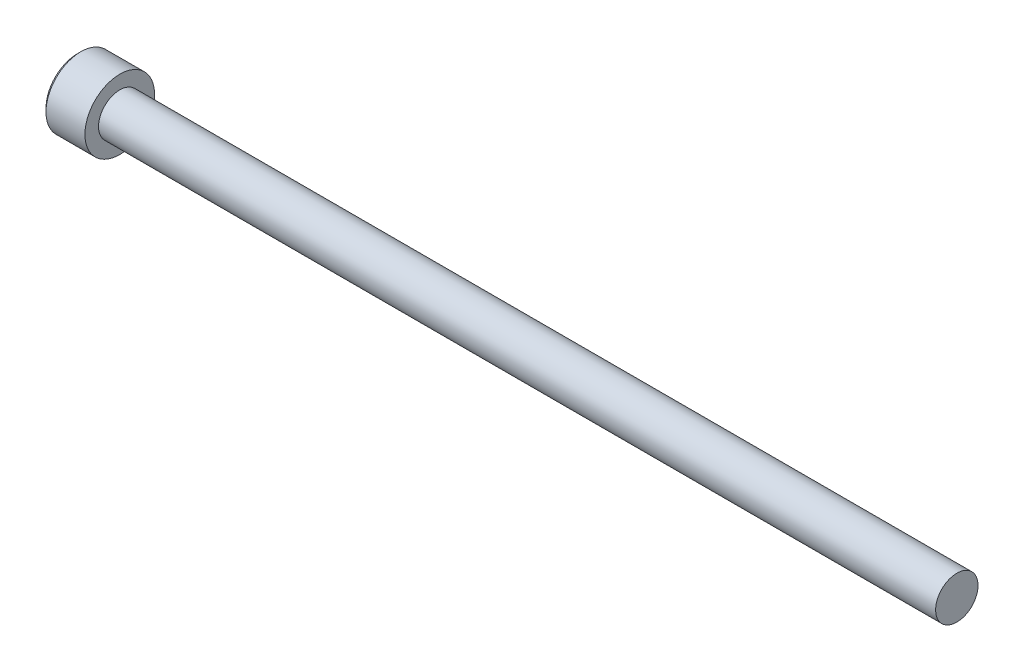
ISO-10303-21;
HEADER;
FILE_DESCRIPTION(('STEP AP214'),'2;1');
FILE_NAME('part.step','',(''),(''),'','','');
FILE_SCHEMA(('AUTOMOTIVE_DESIGN { 1 0 10303 214 1 1 1 1 }'));
ENDSEC;
DATA;
#1=APPLICATION_CONTEXT('core data for automotive mechanical design processes');
#2=APPLICATION_PROTOCOL_DEFINITION('international standard','automotive_design',2000,#1);
#3=PRODUCT_CONTEXT('',#1,'mechanical');
#4=PRODUCT('Part','Part','',(#3));
#5=PRODUCT_RELATED_PRODUCT_CATEGORY('part','',(#4));
#6=PRODUCT_DEFINITION_FORMATION('','',#4);
#7=PRODUCT_DEFINITION_CONTEXT('part definition',#1,'design');
#8=PRODUCT_DEFINITION('design','',#6,#7);
#9=PRODUCT_DEFINITION_SHAPE('','',#8);
#10=(LENGTH_UNIT() NAMED_UNIT(*) SI_UNIT(.MILLI.,.METRE.));
#11=(NAMED_UNIT(*) PLANE_ANGLE_UNIT() SI_UNIT($,.RADIAN.));
#12=(NAMED_UNIT(*) SI_UNIT($,.STERADIAN.) SOLID_ANGLE_UNIT());
#13=UNCERTAINTY_MEASURE_WITH_UNIT(LENGTH_MEASURE(1.E-05),#10,'distance_accuracy_value','');
#14=(GEOMETRIC_REPRESENTATION_CONTEXT(3) GLOBAL_UNCERTAINTY_ASSIGNED_CONTEXT((#13)) GLOBAL_UNIT_ASSIGNED_CONTEXT((#10,
#11,#12)) REPRESENTATION_CONTEXT('',''));
#15=CARTESIAN_POINT('',(0.,0.,0.));
#16=DIRECTION('',(0.,0.,1.));
#17=DIRECTION('',(1.,0.,0.));
#18=AXIS2_PLACEMENT_3D('',#15,#16,#17);
#19=CARTESIAN_POINT('',(-2.28600000000007,-1.14567944042317,1.984375));
#20=DIRECTION('',(0.,0.,1.));
#21=DIRECTION('',(1.,0.,0.));
#22=AXIS2_PLACEMENT_3D('',#19,#20,#21);
#23=PLANE('',#22);
#24=CARTESIAN_POINT('',(-4.82599999995852,1.14567944044653,1.98437499999554));
#25=CARTESIAN_POINT('',(-4.78691618362732,1.06743880343266,1.9843749999984));
#26=CARTESIAN_POINT('',(-4.75011447684892,0.987898318960917,1.98437499999957));
#27=CARTESIAN_POINT('',(-4.68265620500518,0.825677042028778,1.98437500000043));
#28=CARTESIAN_POINT('',(-4.65204056061138,0.742979382529199,1.98437500000012));
#29=CARTESIAN_POINT('',(-4.5991739228306,0.575193959555969,1.98437499999988));
#30=CARTESIAN_POINT('',(-4.57689462080725,0.490115359117279,1.98437499999997));
#31=CARTESIAN_POINT('',(-4.54259467221837,0.318093091130193,1.98437500000003));
#32=CARTESIAN_POINT('',(-4.5305423022885,0.231156054976726,1.984375));
#33=CARTESIAN_POINT('',(-4.52249110263747,0.119918521511051,1.984375));
#34=CARTESIAN_POINT('',(-4.52118947557477,0.0959468443046798,1.984375));
#35=CARTESIAN_POINT('',(-4.51945182629813,0.0479845644411998,1.984375));
#36=CARTESIAN_POINT('',(-4.51901533386223,0.0239939791589393,1.984375));
#37=CARTESIAN_POINT('',(-4.51901809008399,-0.0602201717457363,1.984375));
#38=CARTESIAN_POINT('',(-4.52177452299902,-0.120461721905447,1.984375));
#39=CARTESIAN_POINT('',(-4.5326365512493,-0.240474970989197,1.984375));
#40=CARTESIAN_POINT('',(-4.54074587749718,-0.300246312758427,1.984375));
#41=CARTESIAN_POINT('',(-4.57259622946939,-0.478763752804282,1.984375));
#42=CARTESIAN_POINT('',(-4.60385422611702,-0.596208828937734,1.984375));
#43=CARTESIAN_POINT('',(-4.66780003592237,-0.785921487441256,1.984375));
#44=CARTESIAN_POINT('',(-4.69623457768558,-0.859734609866899,1.984375));
#45=CARTESIAN_POINT('',(-4.75786140400812,-1.00456595519282,1.984375));
#46=CARTESIAN_POINT('',(-4.79100779300359,-1.07560356657101,1.984375));
#47=CARTESIAN_POINT('',(-4.82599999995643,-1.14567944044724,1.984375));
#48=B_SPLINE_CURVE_WITH_KNOTS('',3,(#24,#25,#26,#27,#28,#29,#30,#31,#32,#33,#34,#35,#36,#37,#38,
#39,#40,#41,#42,#43,#44,#45,#46,#47),.UNSPECIFIED.,.F.,.F.,(4,2,2,2,2,2,2,2,2,2,2,4),(0.,
0.262559005207405,0.526801735838036,0.790138824405318,1.05265603861765,1.12466619182083,
1.19663719499031,1.3772702672652,1.55802937209382,1.92104085090328,2.15819130092264,
2.39317265078575),.UNSPECIFIED.);
#49=CARTESIAN_POINT('',(-4.82599999996829,1.14567944041753,1.98437500003084));
#50=VERTEX_POINT('',#49);
#51=CARTESIAN_POINT('',(-4.8259999999622,-1.14567944043207,1.98437500001542));
#52=VERTEX_POINT('',#51);
#53=EDGE_CURVE('E29',#50,#52,#48,.T.);
#54=ORIENTED_EDGE('',*,*,#53,.F.);
#55=DIRECTION('',(1.,0.,0.));
#56=VECTOR('',#55,1.);
#57=CARTESIAN_POINT('',(-2.28600000000007,1.14567944042316,1.984375));
#58=LINE('',#57,#56);
#59=CARTESIAN_POINT('',(-2.28600000000007,1.14567944042316,1.984375));
#60=VERTEX_POINT('',#59);
#61=EDGE_CURVE('E77',#50,#60,#58,.T.);
#62=ORIENTED_EDGE('',*,*,#61,.T.);
#63=DIRECTION('',(0.,1.,0.));
#64=VECTOR('',#63,1.);
#65=CARTESIAN_POINT('',(-2.28600000000007,0.,1.984375));
#66=LINE('',#65,#64);
#67=CARTESIAN_POINT('',(-2.28600000000007,-1.14567944042317,1.984375));
#68=VERTEX_POINT('',#67);
#69=EDGE_CURVE('E83',#68,#60,#66,.T.);
#70=ORIENTED_EDGE('',*,*,#69,.F.);
#71=DIRECTION('',(1.,0.,0.));
#72=VECTOR('',#71,1.);
#73=CARTESIAN_POINT('',(-2.28600000000007,-1.14567944042317,1.984375));
#74=LINE('',#73,#72);
#75=EDGE_CURVE('E80',#68,#52,#74,.F.);
#76=ORIENTED_EDGE('',*,*,#75,.T.);
#77=EDGE_LOOP('',(#54,#62,#70,#76));
#78=FACE_BOUND('',#77,.T.);
#79=ADVANCED_FACE('F25',(#78),#23,.F.);
#80=CARTESIAN_POINT('',(-2.28600000000007,0.,0.));
#81=DIRECTION('',(-1.,0.,0.));
#82=DIRECTION('',(0.,0.,1.));
#83=AXIS2_PLACEMENT_3D('',#80,#81,#82);
#84=PLANE('',#83);
#85=DIRECTION('',(0.,0.5,0.866025403784439));
#86=VECTOR('',#85,1.);
#87=CARTESIAN_POINT('',(-2.28600000000007,2.29135888084633,0.));
#88=LINE('',#87,#86);
#89=CARTESIAN_POINT('',(-2.28600000000007,2.29135888084633,0.));
#90=VERTEX_POINT('',#89);
#91=CARTESIAN_POINT('',(-2.28600000000007,1.14567944042316,-1.984375));
#92=VERTEX_POINT('',#91);
#93=EDGE_CURVE('E91',#90,#92,#88,.F.);
#94=ORIENTED_EDGE('',*,*,#93,.T.);
#95=DIRECTION('',(0.,1.,0.));
#96=VECTOR('',#95,1.);
#97=CARTESIAN_POINT('',(-2.28600000000007,1.14567944042316,-1.984375));
#98=LINE('',#97,#96);
#99=CARTESIAN_POINT('',(-2.28600000000007,-1.14567944042316,-1.984375));
#100=VERTEX_POINT('',#99);
#101=EDGE_CURVE('E251',#92,#100,#98,.F.);
#102=ORIENTED_EDGE('',*,*,#101,.T.);
#103=DIRECTION('',(0.,0.5,-0.866025403784439));
#104=VECTOR('',#103,1.);
#105=CARTESIAN_POINT('',(-2.28600000000007,-1.14567944042316,-1.984375));
#106=LINE('',#105,#104);
#107=CARTESIAN_POINT('',(-2.28600000000007,-2.29135888084633,0.));
#108=VERTEX_POINT('',#107);
#109=EDGE_CURVE('E236',#100,#108,#106,.F.);
#110=ORIENTED_EDGE('',*,*,#109,.T.);
#111=DIRECTION('',(0.,-0.5,-0.866025403784439));
#112=VECTOR('',#111,1.);
#113=CARTESIAN_POINT('',(-2.28600000000007,-2.29135888084633,0.));
#114=LINE('',#113,#112);
#115=EDGE_CURVE('E233',#108,#68,#114,.F.);
#116=ORIENTED_EDGE('',*,*,#115,.T.);
#117=ORIENTED_EDGE('',*,*,#69,.T.);
#118=DIRECTION('',(0.,-0.5,0.866025403784439));
#119=VECTOR('',#118,1.);
#120=CARTESIAN_POINT('',(-2.28600000000007,1.14567944042316,1.984375));
#121=LINE('',#120,#119);
#122=EDGE_CURVE('E90',#60,#90,#121,.F.);
#123=ORIENTED_EDGE('',*,*,#122,.T.);
#124=EDGE_LOOP('',(#94,#102,#110,#116,#117,#123));
#125=FACE_BOUND('',#124,.T.);
#126=ADVANCED_FACE('F169',(#125),#84,.T.);
#127=CARTESIAN_POINT('',(-2.28600000000007,-1.14567944042316,-1.984375));
#128=DIRECTION('',(0.,-0.866025403784439,-0.5));
#129=DIRECTION('',(0.,0.5,-0.866025403784439));
#130=AXIS2_PLACEMENT_3D('',#127,#128,#129);
#131=PLANE('',#130);
#132=CARTESIAN_POINT('',(-4.82599999995871,-1.14567944040756,-1.98437500001887));
#133=CARTESIAN_POINT('',(-4.78666022792997,-1.18505700230148,-1.91617106214563));
#134=CARTESIAN_POINT('',(-4.74963132844072,-1.22509295783734,-1.8468267530301));
#135=CARTESIAN_POINT('',(-4.68183299424977,-1.30673037975396,-1.70542659047317));
#136=CARTESIAN_POINT('',(-4.65110127019237,-1.34833960561553,-1.63335729721673));
#137=CARTESIAN_POINT('',(-4.59845762010516,-1.432242568594,-1.48803310243203));
#138=CARTESIAN_POINT('',(-4.57641341195893,-1.47451494967301,-1.41481519064643));
#139=CARTESIAN_POINT('',(-4.54245011067441,-1.55999007976842,-1.26676792253773));
#140=CARTESIAN_POINT('',(-4.53050567471972,-1.6031902195197,-1.19194308559438));
#141=CARTESIAN_POINT('',(-4.51972842752365,-1.67764765054852,-1.06297903205139));
#142=CARTESIAN_POINT('',(-4.51813352794834,-1.70880881707173,-1.00900630841009));
#143=CARTESIAN_POINT('',(-4.52082392138599,-1.77108016542046,-0.901149169214274));
#144=CARTESIAN_POINT('',(-4.52511127545884,-1.80219032554946,-0.847264791239237));
#145=CARTESIAN_POINT('',(-4.53932219421538,-1.86411684097343,-0.740004920189235));
#146=CARTESIAN_POINT('',(-4.54925206045723,-1.8949328285454,-0.686630064029166));
#147=CARTESIAN_POINT('',(-4.5742029484467,-1.95603190279815,-0.580803363127978));
#148=CARTESIAN_POINT('',(-4.58922357974385,-1.98631503016081,-0.528351447923769));
#149=CARTESIAN_POINT('',(-4.63380478900425,-2.06386502548479,-0.394030915895904));
#150=CARTESIAN_POINT('',(-4.66672213384104,-2.11065153226583,-0.312994309042484));
#151=CARTESIAN_POINT('',(-4.72228952038986,-2.17944749410732,-0.193836207777459));
#152=CARTESIAN_POINT('',(-4.74181309375939,-2.20211890802843,-0.154568166986659));
#153=CARTESIAN_POINT('',(-4.78263970065987,-2.24704195201531,-0.0767591723707469));
#154=CARTESIAN_POINT('',(-4.80394164363173,-2.2692938292399,-0.0382177904539708));
#155=CARTESIAN_POINT('',(-4.82599999995675,-2.29135888085868,2.13931096265935E-11));
#156=B_SPLINE_CURVE_WITH_KNOTS('',3,(#132,#133,#134,#135,#136,#137,#138,#139,#140,#141,#142,
#143,#144,#145,#146,#147,#148,#149,#150,#151,#152,#153,#154,#155),.UNSPECIFIED.,.F.,.F.,(4,2,2,
2,2,2,2,2,2,2,2,4),(0.,0.264284909626495,0.530108996358094,0.791712695414128,1.05265800174404,
1.23942150116703,1.42625045663858,1.61328847394198,1.80031214908683,2.09727151182814,
2.24534838946042,2.39333511890876),.UNSPECIFIED.);
#157=CARTESIAN_POINT('',(-4.8259999999622,-1.14567944043207,-1.98437500001542));
#158=VERTEX_POINT('',#157);
#159=CARTESIAN_POINT('',(-4.82599999996846,-2.2913588808704,-2.00043543490866E-11));
#160=VERTEX_POINT('',#159);
#161=EDGE_CURVE('E171',#158,#160,#156,.T.);
#162=ORIENTED_EDGE('',*,*,#161,.T.);
#163=DIRECTION('',(1.,0.,0.));
#164=VECTOR('',#163,1.);
#165=CARTESIAN_POINT('',(-2.28600000000007,-2.29135888084633,0.));
#166=LINE('',#165,#164);
#167=EDGE_CURVE('E244',#160,#108,#166,.T.);
#168=ORIENTED_EDGE('',*,*,#167,.T.);
#169=ORIENTED_EDGE('',*,*,#109,.F.);
#170=DIRECTION('',(-1.,0.,0.));
#171=VECTOR('',#170,1.);
#172=CARTESIAN_POINT('',(-2.28600000000007,-1.14567944042316,-1.984375));
#173=LINE('',#172,#171);
#174=EDGE_CURVE('E254',#100,#158,#173,.T.);
#175=ORIENTED_EDGE('',*,*,#174,.T.);
#176=EDGE_LOOP('',(#162,#168,#169,#175));
#177=FACE_BOUND('',#176,.T.);
#178=ADVANCED_FACE('F165',(#177),#131,.F.);
#179=CARTESIAN_POINT('',(-2.28600000000007,-2.29135888084633,0.));
#180=DIRECTION('',(0.,-0.866025403784439,0.5));
#181=DIRECTION('',(0.,-0.5,-0.866025403784439));
#182=AXIS2_PLACEMENT_3D('',#179,#180,#181);
#183=PLANE('',#182);
#184=CARTESIAN_POINT('',(-4.8259999999587,-2.29135888085486,-2.29477011545215E-11));
#185=CARTESIAN_POINT('',(-4.78666022792997,-2.25198131896546,0.0682039378529047));
#186=CARTESIAN_POINT('',(-4.74963132844072,-2.21194536343147,0.137548246969502));
#187=CARTESIAN_POINT('',(-4.68183299424977,-2.13030794151622,0.278948409527228));
#188=CARTESIAN_POINT('',(-4.65110127019237,-2.08869871565414,0.351017702783377));
#189=CARTESIAN_POINT('',(-4.59845762010516,-2.00479575267531,0.496341897567867));
#190=CARTESIAN_POINT('',(-4.57641341195893,-1.96252337159644,0.569559809353539));
#191=CARTESIAN_POINT('',(-4.5424501106744,-1.87704824150112,0.717607077462299));
#192=CARTESIAN_POINT('',(-4.53050567471972,-1.8338481017498,0.792431914405622));
#193=CARTESIAN_POINT('',(-4.51972842752365,-1.75939067072096,0.921395967948603));
#194=CARTESIAN_POINT('',(-4.51813352794834,-1.72822950419776,0.975368691589913));
#195=CARTESIAN_POINT('',(-4.52082392138599,-1.66595815584903,1.08322583078573));
#196=CARTESIAN_POINT('',(-4.52511127545884,-1.63484799572003,1.13711020876076));
#197=CARTESIAN_POINT('',(-4.53932219421538,-1.57292148029607,1.24437007981077));
#198=CARTESIAN_POINT('',(-4.54925206045723,-1.54210549272409,1.29774493597084));
#199=CARTESIAN_POINT('',(-4.5742029484467,-1.48100641847134,1.40357163687202));
#200=CARTESIAN_POINT('',(-4.58922357974385,-1.45072329110868,1.45602355207623));
#201=CARTESIAN_POINT('',(-4.63380478900421,-1.37317329578476,1.59034408410398));
#202=CARTESIAN_POINT('',(-4.66672213384095,-1.32638678900379,1.6713806909573));
#203=CARTESIAN_POINT('',(-4.72228952038968,-1.25759082716239,1.79053879222216));
#204=CARTESIAN_POINT('',(-4.74181309375917,-1.23491941324131,1.82980683301291));
#205=CARTESIAN_POINT('',(-4.78263970065959,-1.18999636925449,1.90761582762873));
#206=CARTESIAN_POINT('',(-4.8039416436314,-1.16774449202993,1.94615720954545));
#207=CARTESIAN_POINT('',(-4.82599999995639,-1.14567944041117,1.98437500002077));
#208=B_SPLINE_CURVE_WITH_KNOTS('',3,(#184,#185,#186,#187,#188,#189,#190,#191,#192,#193,#194,
#195,#196,#197,#198,#199,#200,#201,#202,#203,#204,#205,#206,#207),.UNSPECIFIED.,.F.,.F.,(4,2,2,
2,2,2,2,2,2,2,2,4),(0.,0.264284909626493,0.530108996358089,0.791712695414125,1.05265800174404,
1.23942150116703,1.42625045663858,1.61328847394198,1.80031214908683,2.09727151182773,
2.24534838945981,2.39333511890795),.UNSPECIFIED.);
#209=EDGE_CURVE('E100',#160,#52,#208,.T.);
#210=ORIENTED_EDGE('',*,*,#209,.T.);
#211=ORIENTED_EDGE('',*,*,#75,.F.);
#212=ORIENTED_EDGE('',*,*,#115,.F.);
#213=ORIENTED_EDGE('',*,*,#167,.F.);
#214=EDGE_LOOP('',(#210,#211,#212,#213));
#215=FACE_BOUND('',#214,.T.);
#216=ADVANCED_FACE('F160',(#215),#183,.F.);
#217=CARTESIAN_POINT('',(-2.28600000000007,1.14567944042316,1.984375));
#218=DIRECTION('',(0.,0.866025403784439,0.5));
#219=DIRECTION('',(0.,-0.5,0.866025403784439));
#220=AXIS2_PLACEMENT_3D('',#217,#218,#219);
#221=PLANE('',#220);
#222=CARTESIAN_POINT('',(-4.82599999995852,1.14567944040762,1.98437500001801));
#223=CARTESIAN_POINT('',(-4.78666022792973,1.1850570023017,1.91617106214498));
#224=CARTESIAN_POINT('',(-4.74963132844047,1.22509295783761,1.84682675302957));
#225=CARTESIAN_POINT('',(-4.68183299424957,1.30673037975422,1.70542659047278));
#226=CARTESIAN_POINT('',(-4.65110127019222,1.34833960561574,1.63335729721638));
#227=CARTESIAN_POINT('',(-4.59845762010509,1.43224256859413,1.48803310243178));
#228=CARTESIAN_POINT('',(-4.57641341195888,1.47451494967311,1.41481519064625));
#229=CARTESIAN_POINT('',(-4.54245011067439,1.55999007976846,1.26676792253767));
#230=CARTESIAN_POINT('',(-4.53050567471972,1.6031902195197,1.19194308559439));
#231=CARTESIAN_POINT('',(-4.51972842752365,1.67764765054848,1.06297903205146));
#232=CARTESIAN_POINT('',(-4.51813352794835,1.70880881707169,1.00900630841016));
#233=CARTESIAN_POINT('',(-4.52082392138598,1.77108016542041,0.901149169214364));
#234=CARTESIAN_POINT('',(-4.52511127545883,1.80219032554941,0.847264791239333));
#235=CARTESIAN_POINT('',(-4.53932219421536,1.86411684097336,0.740004920189342));
#236=CARTESIAN_POINT('',(-4.54925206045721,1.89493282854533,0.686630064029278));
#237=CARTESIAN_POINT('',(-4.57420294844667,1.95603190279808,0.5808033631281));
#238=CARTESIAN_POINT('',(-4.58922357974382,1.98631503016074,0.528351447923897));
#239=CARTESIAN_POINT('',(-4.6338047890042,2.06386502548473,0.394030915896012));
#240=CARTESIAN_POINT('',(-4.666722133841,2.11065153226578,0.312994309042568));
#241=CARTESIAN_POINT('',(-4.72228952038984,2.17944749410729,0.19383620777751));
#242=CARTESIAN_POINT('',(-4.74181309375937,2.20211890802841,0.1545681669867));
#243=CARTESIAN_POINT('',(-4.78263970065986,2.24704195201529,0.0767591723707674));
#244=CARTESIAN_POINT('',(-4.80394164363172,2.26929382923989,0.0382177904539813));
#245=CARTESIAN_POINT('',(-4.82599999995675,2.29135888085868,-2.1392886942985E-11));
#246=B_SPLINE_CURVE_WITH_KNOTS('',3,(#222,#223,#224,#225,#226,#227,#228,#229,#230,#231,#232,
#233,#234,#235,#236,#237,#238,#239,#240,#241,#242,#243,#244,#245),.UNSPECIFIED.,.F.,.F.,(4,2,2,
2,2,2,2,2,2,2,2,4),(0.,0.26428490962629,0.530108996357672,0.791712695413487,1.05265800174319,
1.23942150116616,1.42625045663768,1.61328847394106,1.80031214908589,2.09727151182728,
2.2453483894596,2.39333511890798),.UNSPECIFIED.);
#247=CARTESIAN_POINT('',(-4.82599999996846,2.29135888087039,2.00042061038936E-11));
#248=VERTEX_POINT('',#247);
#249=EDGE_CURVE('E88',#50,#248,#246,.T.);
#250=ORIENTED_EDGE('',*,*,#249,.T.);
#251=DIRECTION('',(1.,0.,0.));
#252=VECTOR('',#251,1.);
#253=CARTESIAN_POINT('',(-2.28600000000007,2.29135888084633,0.));
#254=LINE('',#253,#252);
#255=EDGE_CURVE('E255',#248,#90,#254,.T.);
#256=ORIENTED_EDGE('',*,*,#255,.T.);
#257=ORIENTED_EDGE('',*,*,#122,.F.);
#258=ORIENTED_EDGE('',*,*,#61,.F.);
#259=EDGE_LOOP('',(#250,#256,#257,#258));
#260=FACE_BOUND('',#259,.T.);
#261=ADVANCED_FACE('F85',(#260),#221,.F.);
#262=CARTESIAN_POINT('',(-2.28600000000007,2.29135888084633,0.));
#263=DIRECTION('',(0.,0.866025403784439,-0.5));
#264=DIRECTION('',(0.,0.5,0.866025403784439));
#265=AXIS2_PLACEMENT_3D('',#262,#263,#264);
#266=PLANE('',#265);
#267=CARTESIAN_POINT('',(-4.82599999995871,2.29135888085486,2.29489280696874E-11));
#268=CARTESIAN_POINT('',(-4.78666022792997,2.25198131896547,-0.0682039378529039));
#269=CARTESIAN_POINT('',(-4.74963132844072,2.21194536343147,-0.137548246969502));
#270=CARTESIAN_POINT('',(-4.68183299424977,2.13030794151622,-0.278948409527229));
#271=CARTESIAN_POINT('',(-4.65110127019237,2.08869871565414,-0.351017702783379));
#272=CARTESIAN_POINT('',(-4.59845762010516,2.00479575267531,-0.496341897567869));
#273=CARTESIAN_POINT('',(-4.57641341195893,1.96252337159644,-0.569559809353541));
#274=CARTESIAN_POINT('',(-4.5424501106744,1.87704824150112,-0.7176070774623));
#275=CARTESIAN_POINT('',(-4.53050567471972,1.8338481017498,-0.792431914405622));
#276=CARTESIAN_POINT('',(-4.51972842752365,1.75939067072096,-0.921395967948603));
#277=CARTESIAN_POINT('',(-4.51813352794834,1.72822950419776,-0.975368691589912));
#278=CARTESIAN_POINT('',(-4.52082392138599,1.66595815584903,-1.08322583078573));
#279=CARTESIAN_POINT('',(-4.52511127545884,1.63484799572003,-1.13711020876076));
#280=CARTESIAN_POINT('',(-4.53932219421538,1.57292148029607,-1.24437007981077));
#281=CARTESIAN_POINT('',(-4.54925206045723,1.54210549272409,-1.29774493597083));
#282=CARTESIAN_POINT('',(-4.5742029484467,1.48100641847134,-1.40357163687202));
#283=CARTESIAN_POINT('',(-4.58922357974385,1.45072329110868,-1.45602355207623));
#284=CARTESIAN_POINT('',(-4.63380478900425,1.3731732957847,-1.5903440841041));
#285=CARTESIAN_POINT('',(-4.66672213384104,1.32638678900366,-1.67138069095752));
#286=CARTESIAN_POINT('',(-4.72228952038986,1.25759082716218,-1.79053879222254));
#287=CARTESIAN_POINT('',(-4.74181309375939,1.23491941324106,-1.82980683301334));
#288=CARTESIAN_POINT('',(-4.78263970065987,1.18999636925419,-1.90761582762925));
#289=CARTESIAN_POINT('',(-4.80394164363173,1.1677444920296,-1.94615720954603));
#290=CARTESIAN_POINT('',(-4.82599999995675,1.14567944041081,-1.98437500002139));
#291=B_SPLINE_CURVE_WITH_KNOTS('',3,(#267,#268,#269,#270,#271,#272,#273,#274,#275,#276,#277,
#278,#279,#280,#281,#282,#283,#284,#285,#286,#287,#288,#289,#290),.UNSPECIFIED.,.F.,.F.,(4,2,2,
2,2,2,2,2,2,2,2,4),(0.,0.264284909626495,0.530108996358093,0.791712695414127,1.05265800174404,
1.23942150116703,1.42625045663858,1.61328847394198,1.80031214908683,2.09727151182814,
2.24534838946042,2.39333511890876),.UNSPECIFIED.);
#292=CARTESIAN_POINT('',(-4.82599999996846,1.14567944045252,-1.98437500001084));
#293=VERTEX_POINT('',#292);
#294=EDGE_CURVE('E48',#248,#293,#291,.T.);
#295=ORIENTED_EDGE('',*,*,#294,.T.);
#296=DIRECTION('',(-1.,0.,0.));
#297=VECTOR('',#296,1.);
#298=CARTESIAN_POINT('',(-2.28600000000007,1.14567944042316,-1.984375));
#299=LINE('',#298,#297);
#300=EDGE_CURVE('E175',#293,#92,#299,.F.);
#301=ORIENTED_EDGE('',*,*,#300,.T.);
#302=ORIENTED_EDGE('',*,*,#93,.F.);
#303=ORIENTED_EDGE('',*,*,#255,.F.);
#304=EDGE_LOOP('',(#295,#301,#302,#303));
#305=FACE_BOUND('',#304,.T.);
#306=ADVANCED_FACE('F159',(#305),#266,.F.);
#307=CARTESIAN_POINT('',(-2.28600000000007,1.14567944042316,-1.984375));
#308=DIRECTION('',(0.,0.,-1.));
#309=DIRECTION('',(-1.,0.,0.));
#310=AXIS2_PLACEMENT_3D('',#307,#308,#309);
#311=PLANE('',#310);
#312=CARTESIAN_POINT('',(-4.8259999999587,1.14567944044731,-1.98437499999592));
#313=CARTESIAN_POINT('',(-4.78666022793094,1.06692431665146,-1.98437499999853));
#314=CARTESIAN_POINT('',(-4.74963132844318,0.986852405569011,-1.98437499999961));
#315=CARTESIAN_POINT('',(-4.6818329942566,0.823577561711963,-1.9843750000004));
#316=CARTESIAN_POINT('',(-4.65110127020207,0.740359109975722,-1.98437500000011));
#317=CARTESIAN_POINT('',(-4.59845762012233,0.572553183993917,-1.9843749999999));
#318=CARTESIAN_POINT('',(-4.57641341198063,0.488008421824127,-1.98437499999997));
#319=CARTESIAN_POINT('',(-4.54245011070673,0.317058161610178,-1.98437500000003));
#320=CARTESIAN_POINT('',(-4.53050567475816,0.230657882096267,-1.98437500000001));
#321=CARTESIAN_POINT('',(-4.51972842757294,0.0817430200124032,-1.984375));
#322=CARTESIAN_POINT('',(-4.51813352800283,0.0194206869508218,-1.984375));
#323=CARTESIAN_POINT('',(-4.52082392145254,-0.1051220097764,-1.984375));
#324=CARTESIAN_POINT('',(-4.52511127553227,-0.167342330049008,-1.984375));
#325=CARTESIAN_POINT('',(-4.53932219430377,-0.291195360925477,-1.984375));
#326=CARTESIAN_POINT('',(-4.54925206055372,-0.352827336083362,-1.984375));
#327=CARTESIAN_POINT('',(-4.57420294856008,-0.475025484616114,-1.984375));
#328=CARTESIAN_POINT('',(-4.58922357986604,-0.535591739354747,-1.984375));
#329=CARTESIAN_POINT('',(-4.63380478912724,-0.690691729958653,-1.984375));
#330=CARTESIAN_POINT('',(-4.66672213394715,-0.784264743465576,-1.984375));
#331=CARTESIAN_POINT('',(-4.7222895204619,-0.921856667069616,-1.984375));
#332=CARTESIAN_POINT('',(-4.74181309381856,-0.967199494886089,-1.984375));
#333=CARTESIAN_POINT('',(-4.78263970069104,-1.05704558280959,-1.984375));
#334=CARTESIAN_POINT('',(-4.80394164364776,-1.10154933723428,-1.984375));
#335=CARTESIAN_POINT('',(-4.82599999995675,-1.14567944044787,-1.984375));
#336=B_SPLINE_CURVE_WITH_KNOTS('',3,(#312,#313,#314,#315,#316,#317,#318,#319,#320,#321,#322,
#323,#324,#325,#326,#327,#328,#329,#330,#331,#332,#333,#334,#335),.UNSPECIFIED.,.F.,.F.,(4,2,2,
2,2,2,2,2,2,2,2,4),(0.,0.264284909658836,0.530108996422784,0.791712695509868,1.0526580018708,
1.23942150133878,1.42625045685537,1.61328847420389,1.80031214939384,2.09727151196384,
2.24534838950992,2.39333511887245),.UNSPECIFIED.);
#337=EDGE_CURVE('E117',#293,#158,#336,.T.);
#338=ORIENTED_EDGE('',*,*,#337,.T.);
#339=ORIENTED_EDGE('',*,*,#174,.F.);
#340=ORIENTED_EDGE('',*,*,#101,.F.);
#341=ORIENTED_EDGE('',*,*,#300,.F.);
#342=EDGE_LOOP('',(#338,#339,#340,#341));
#343=FACE_BOUND('',#342,.T.);
#344=ADVANCED_FACE('F130',(#343),#311,.F.);
#345=CARTESIAN_POINT('',(-4.82599999998001,0.,0.));
#346=DIRECTION('',(-1.,0.,0.));
#347=DIRECTION('',(0.,0.,1.));
#348=AXIS2_PLACEMENT_3D('',#345,#346,#347);
#349=CONICAL_SURFACE('',#348,2.29135888088194,0.785398163397448);
#350=ORIENTED_EDGE('',*,*,#161,.F.);
#351=CARTESIAN_POINT('',(-4.82599999998001,0.,0.));
#352=DIRECTION('',(-1.,0.,0.));
#353=DIRECTION('',(0.,0.,1.));
#354=AXIS2_PLACEMENT_3D('',#351,#352,#353);
#355=CIRCLE('',#354,2.29135888088194);
#356=EDGE_CURVE('E114',#158,#160,#355,.T.);
#357=ORIENTED_EDGE('',*,*,#356,.T.);
#358=EDGE_LOOP('',(#350,#357));
#359=FACE_BOUND('',#358,.T.);
#360=ADVANCED_FACE('F176',(#359),#349,.F.);
#361=CARTESIAN_POINT('',(-4.82599999998001,0.,0.));
#362=DIRECTION('',(-1.,0.,0.));
#363=DIRECTION('',(0.,0.,1.));
#364=AXIS2_PLACEMENT_3D('',#361,#362,#363);
#365=CONICAL_SURFACE('',#364,2.29135888088194,0.785398163397448);
#366=ORIENTED_EDGE('',*,*,#209,.F.);
#367=CARTESIAN_POINT('',(-4.82599999998001,0.,0.));
#368=DIRECTION('',(-1.,0.,0.));
#369=DIRECTION('',(0.,0.,1.));
#370=AXIS2_PLACEMENT_3D('',#367,#368,#369);
#371=CIRCLE('',#370,2.29135888088194);
#372=EDGE_CURVE('E95',#160,#52,#371,.T.);
#373=ORIENTED_EDGE('',*,*,#372,.T.);
#374=EDGE_LOOP('',(#366,#373));
#375=FACE_BOUND('',#374,.T.);
#376=ADVANCED_FACE('F179',(#375),#365,.F.);
#377=CARTESIAN_POINT('',(-4.82599999998001,0.,0.));
#378=DIRECTION('',(-1.,0.,0.));
#379=DIRECTION('',(0.,0.,1.));
#380=AXIS2_PLACEMENT_3D('',#377,#378,#379);
#381=CONICAL_SURFACE('',#380,2.29135888088194,0.78539816348948);
#382=CARTESIAN_POINT('',(-4.82599999998001,0.,0.));
#383=DIRECTION('',(-1.,0.,0.));
#384=DIRECTION('',(0.,0.,1.));
#385=AXIS2_PLACEMENT_3D('',#382,#383,#384);
#386=CIRCLE('',#385,2.29135888088194);
#387=EDGE_CURVE('E68',#52,#50,#386,.T.);
#388=ORIENTED_EDGE('',*,*,#387,.T.);
#389=ORIENTED_EDGE('',*,*,#53,.T.);
#390=EDGE_LOOP('',(#388,#389));
#391=FACE_BOUND('',#390,.T.);
#392=ADVANCED_FACE('F93',(#391),#381,.F.);
#393=CARTESIAN_POINT('',(-4.82599999998001,0.,0.));
#394=DIRECTION('',(-1.,0.,0.));
#395=DIRECTION('',(0.,0.,1.));
#396=AXIS2_PLACEMENT_3D('',#393,#394,#395);
#397=CONICAL_SURFACE('',#396,2.29135888088194,0.785398163397448);
#398=ORIENTED_EDGE('',*,*,#249,.F.);
#399=CARTESIAN_POINT('',(-4.82599999998001,0.,0.));
#400=DIRECTION('',(-1.,0.,0.));
#401=DIRECTION('',(0.,0.,1.));
#402=AXIS2_PLACEMENT_3D('',#399,#400,#401);
#403=CIRCLE('',#402,2.29135888088194);
#404=EDGE_CURVE('E94',#50,#248,#403,.T.);
#405=ORIENTED_EDGE('',*,*,#404,.T.);
#406=EDGE_LOOP('',(#398,#405));
#407=FACE_BOUND('',#406,.T.);
#408=ADVANCED_FACE('F99',(#407),#397,.F.);
#409=CARTESIAN_POINT('',(-4.82599999998001,0.,0.));
#410=DIRECTION('',(-1.,0.,0.));
#411=DIRECTION('',(0.,0.,1.));
#412=AXIS2_PLACEMENT_3D('',#409,#410,#411);
#413=CONICAL_SURFACE('',#412,2.29135888088194,0.785398163397448);
#414=ORIENTED_EDGE('',*,*,#294,.F.);
#415=CARTESIAN_POINT('',(-4.82599999998001,0.,0.));
#416=DIRECTION('',(-1.,0.,0.));
#417=DIRECTION('',(0.,0.,1.));
#418=AXIS2_PLACEMENT_3D('',#415,#416,#417);
#419=CIRCLE('',#418,2.29135888088194);
#420=EDGE_CURVE('E106',#248,#293,#419,.T.);
#421=ORIENTED_EDGE('',*,*,#420,.T.);
#422=EDGE_LOOP('',(#414,#421));
#423=FACE_BOUND('',#422,.T.);
#424=ADVANCED_FACE('F137',(#423),#413,.F.);
#425=CARTESIAN_POINT('',(-4.82599999998001,0.,0.));
#426=DIRECTION('',(-1.,0.,0.));
#427=DIRECTION('',(0.,0.,1.));
#428=AXIS2_PLACEMENT_3D('',#425,#426,#427);
#429=CONICAL_SURFACE('',#428,2.29135888088194,0.785398163489476);
#430=ORIENTED_EDGE('',*,*,#337,.F.);
#431=CARTESIAN_POINT('',(-4.82599999998001,0.,0.));
#432=DIRECTION('',(-1.,0.,0.));
#433=DIRECTION('',(0.,0.,1.));
#434=AXIS2_PLACEMENT_3D('',#431,#432,#433);
#435=CIRCLE('',#434,2.29135888088194);
#436=EDGE_CURVE('E108',#293,#158,#435,.T.);
#437=ORIENTED_EDGE('',*,*,#436,.T.);
#438=EDGE_LOOP('',(#430,#437));
#439=FACE_BOUND('',#438,.T.);
#440=ADVANCED_FACE('F133',(#439),#429,.F.);
#441=CARTESIAN_POINT('',(-4.82600000000007,0.,0.));
#442=DIRECTION('',(1.,0.,0.));
#443=DIRECTION('',(0.,0.,-1.));
#444=AXIS2_PLACEMENT_3D('',#441,#442,#443);
#445=PLANE('',#444);
#446=CARTESIAN_POINT('',(-4.82599999998001,0.,0.));
#447=DIRECTION('',(1.,0.,0.));
#448=DIRECTION('',(0.,0.,-1.));
#449=AXIS2_PLACEMENT_3D('',#446,#447,#448);
#450=CIRCLE('',#449,3.56615999999121);
#451=CARTESIAN_POINT('',(-4.82599999998001,0.,-3.56615999999121));
#452=VERTEX_POINT('',#451);
#453=EDGE_CURVE('E221',#452,#452,#450,.T.);
#454=ORIENTED_EDGE('',*,*,#453,.F.);
#455=EDGE_LOOP('',(#454));
#456=FACE_BOUND('',#455,.T.);
#457=ORIENTED_EDGE('',*,*,#420,.F.);
#458=ORIENTED_EDGE('',*,*,#404,.F.);
#459=ORIENTED_EDGE('',*,*,#387,.F.);
#460=ORIENTED_EDGE('',*,*,#372,.F.);
#461=ORIENTED_EDGE('',*,*,#356,.F.);
#462=ORIENTED_EDGE('',*,*,#436,.F.);
#463=EDGE_LOOP('',(#457,#458,#459,#460,#461,#462));
#464=FACE_BOUND('',#463,.T.);
#465=ADVANCED_FACE('F103',(#456,#464),#445,.F.);
#466=CARTESIAN_POINT('',(-4.42976000010731,0.,0.));
#467=DIRECTION('',(1.,0.,0.));
#468=DIRECTION('',(0.,0.,-1.));
#469=AXIS2_PLACEMENT_3D('',#466,#467,#468);
#470=CONICAL_SURFACE('',#469,3.96239999986392,0.785398163397448);
#471=CARTESIAN_POINT('',(-4.42976000000007,0.,0.));
#472=DIRECTION('',(-1.,0.,0.));
#473=DIRECTION('',(0.,0.,1.));
#474=AXIS2_PLACEMENT_3D('',#471,#472,#473);
#475=CIRCLE('',#474,3.9624);
#476=CARTESIAN_POINT('',(-4.42976000000007,0.,3.9624));
#477=VERTEX_POINT('',#476);
#478=EDGE_CURVE('E218',#477,#477,#475,.F.);
#479=ORIENTED_EDGE('',*,*,#478,.F.);
#480=EDGE_LOOP('',(#479));
#481=FACE_BOUND('',#480,.T.);
#482=ORIENTED_EDGE('',*,*,#453,.T.);
#483=EDGE_LOOP('',(#482));
#484=FACE_BOUND('',#483,.T.);
#485=ADVANCED_FACE('F207',(#481,#484),#470,.T.);
#486=CARTESIAN_POINT('',(-4.82600000000008,0.,0.));
#487=DIRECTION('',(-1.,0.,0.));
#488=DIRECTION('',(0.,0.,1.));
#489=AXIS2_PLACEMENT_3D('',#486,#487,#488);
#490=CYLINDRICAL_SURFACE('',#489,3.9624);
#491=ORIENTED_EDGE('',*,*,#478,.T.);
#492=EDGE_LOOP('',(#491));
#493=FACE_BOUND('',#492,.T.);
#494=CARTESIAN_POINT('',(0.,0.,0.));
#495=DIRECTION('',(-1.,0.,0.));
#496=DIRECTION('',(0.,0.,1.));
#497=AXIS2_PLACEMENT_3D('',#494,#495,#496);
#498=CIRCLE('',#497,3.9624);
#499=CARTESIAN_POINT('',(0.,0.,3.9624));
#500=VERTEX_POINT('',#499);
#501=EDGE_CURVE('E223',#500,#500,#498,.T.);
#502=ORIENTED_EDGE('',*,*,#501,.T.);
#503=EDGE_LOOP('',(#502));
#504=FACE_BOUND('',#503,.T.);
#505=ADVANCED_FACE('F204',(#493,#504),#490,.T.);
#506=CARTESIAN_POINT('',(95.25,0.,0.));
#507=DIRECTION('',(1.,0.,0.));
#508=DIRECTION('',(0.,0.,-1.));
#509=AXIS2_PLACEMENT_3D('',#506,#507,#508);
#510=PLANE('',#509);
#511=CARTESIAN_POINT('',(95.25,0.,0.));
#512=DIRECTION('',(-1.,0.,0.));
#513=DIRECTION('',(0.,0.,1.));
#514=AXIS2_PLACEMENT_3D('',#511,#512,#513);
#515=CIRCLE('',#514,2.413);
#516=CARTESIAN_POINT('',(95.25,0.,2.413));
#517=VERTEX_POINT('',#516);
#518=EDGE_CURVE('E39',#517,#517,#515,.T.);
#519=ORIENTED_EDGE('',*,*,#518,.F.);
#520=EDGE_LOOP('',(#519));
#521=FACE_BOUND('',#520,.T.);
#522=ADVANCED_FACE('F197',(#521),#510,.T.);
#523=CARTESIAN_POINT('',(0.,3.9624,0.));
#524=DIRECTION('',(-1.,0.,0.));
#525=DIRECTION('',(0.,0.,1.));
#526=AXIS2_PLACEMENT_3D('',#523,#524,#525);
#527=PLANE('',#526);
#528=CARTESIAN_POINT('',(0.,0.,0.));
#529=DIRECTION('',(-1.,0.,0.));
#530=DIRECTION('',(0.,0.,1.));
#531=AXIS2_PLACEMENT_3D('',#528,#529,#530);
#532=CIRCLE('',#531,2.413);
#533=CARTESIAN_POINT('',(0.,0.,2.413));
#534=VERTEX_POINT('',#533);
#535=EDGE_CURVE('E13',#534,#534,#532,.F.);
#536=ORIENTED_EDGE('',*,*,#535,.F.);
#537=EDGE_LOOP('',(#536));
#538=FACE_BOUND('',#537,.T.);
#539=ORIENTED_EDGE('',*,*,#501,.F.);
#540=EDGE_LOOP('',(#539));
#541=FACE_BOUND('',#540,.T.);
#542=ADVANCED_FACE('F191',(#538,#541),#527,.F.);
#543=CARTESIAN_POINT('',(95.25,0.,0.));
#544=DIRECTION('',(-1.,0.,0.));
#545=DIRECTION('',(0.,0.,1.));
#546=AXIS2_PLACEMENT_3D('',#543,#544,#545);
#547=CYLINDRICAL_SURFACE('',#546,2.413);
#548=ORIENTED_EDGE('',*,*,#535,.T.);
#549=EDGE_LOOP('',(#548));
#550=FACE_BOUND('',#549,.T.);
#551=ORIENTED_EDGE('',*,*,#518,.T.);
#552=EDGE_LOOP('',(#551));
#553=FACE_BOUND('',#552,.T.);
#554=ADVANCED_FACE('F189',(#550,#553),#547,.T.);
#555=CLOSED_SHELL('',(#79,#126,#178,#216,#261,#306,#344,#360,#376,#392,#408,#424,#440,#465,#485,
#505,#522,#542,#554));
#556=MANIFOLD_SOLID_BREP('B1',#555);
#557=ADVANCED_BREP_SHAPE_REPRESENTATION('',(#18,#556),#14);
#558=SHAPE_DEFINITION_REPRESENTATION(#9,#557);
ENDSEC;
END-ISO-10303-21;
